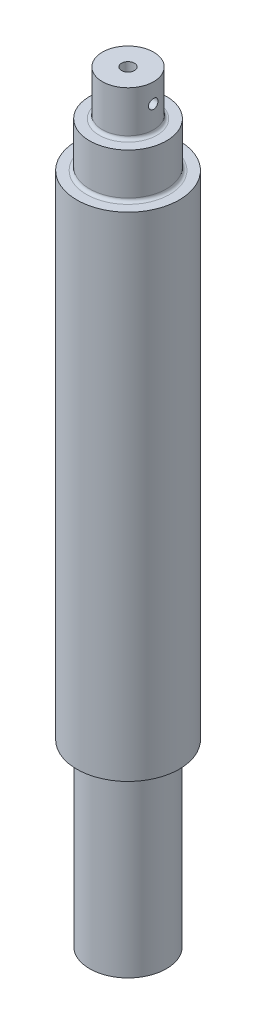
ISO-10303-21;
HEADER;
FILE_DESCRIPTION(('STEP AP214'),'2;1');
FILE_NAME('part.step','',(''),(''),'','','');
FILE_SCHEMA(('AUTOMOTIVE_DESIGN { 1 0 10303 214 1 1 1 1 }'));
ENDSEC;
DATA;
#1=APPLICATION_CONTEXT('core data for automotive mechanical design processes');
#2=APPLICATION_PROTOCOL_DEFINITION('international standard','automotive_design',2000,#1);
#3=PRODUCT_CONTEXT('',#1,'mechanical');
#4=PRODUCT('Part','Part','',(#3));
#5=PRODUCT_RELATED_PRODUCT_CATEGORY('part','',(#4));
#6=PRODUCT_DEFINITION_FORMATION('','',#4);
#7=PRODUCT_DEFINITION_CONTEXT('part definition',#1,'design');
#8=PRODUCT_DEFINITION('design','',#6,#7);
#9=PRODUCT_DEFINITION_SHAPE('','',#8);
#10=(LENGTH_UNIT() NAMED_UNIT(*) SI_UNIT(.MILLI.,.METRE.));
#11=(NAMED_UNIT(*) PLANE_ANGLE_UNIT() SI_UNIT($,.RADIAN.));
#12=(NAMED_UNIT(*) SI_UNIT($,.STERADIAN.) SOLID_ANGLE_UNIT());
#13=UNCERTAINTY_MEASURE_WITH_UNIT(LENGTH_MEASURE(1.E-05),#10,'distance_accuracy_value','');
#14=(GEOMETRIC_REPRESENTATION_CONTEXT(3) GLOBAL_UNCERTAINTY_ASSIGNED_CONTEXT((#13)) GLOBAL_UNIT_ASSIGNED_CONTEXT((#10,
#11,#12)) REPRESENTATION_CONTEXT('',''));
#15=CARTESIAN_POINT('',(0.,0.,0.));
#16=DIRECTION('',(0.,0.,1.));
#17=DIRECTION('',(1.,0.,0.));
#18=AXIS2_PLACEMENT_3D('',#15,#16,#17);
#19=CARTESIAN_POINT('',(9.51229999999999,-105.56875,0.));
#20=DIRECTION('',(0.,1.,0.));
#21=DIRECTION('',(0.,0.,1.));
#22=AXIS2_PLACEMENT_3D('',#19,#20,#21);
#23=PLANE('',#22);
#24=CARTESIAN_POINT('',(0.,-105.56875,0.));
#25=DIRECTION('',(0.,-1.,0.));
#26=DIRECTION('',(0.,0.,-1.));
#27=AXIS2_PLACEMENT_3D('',#24,#25,#26);
#28=CIRCLE('',#27,9.51229999999999);
#29=CARTESIAN_POINT('',(0.,-105.56875,-9.51229999999999));
#30=VERTEX_POINT('',#29);
#31=EDGE_CURVE('E10',#30,#30,#28,.T.);
#32=ORIENTED_EDGE('',*,*,#31,.T.);
#33=EDGE_LOOP('',(#32));
#34=FACE_BOUND('',#33,.T.);
#35=ADVANCED_FACE('F33',(#34),#23,.F.);
#36=CARTESIAN_POINT('',(0.,-122.193490480669,0.));
#37=DIRECTION('',(0.,-1.,0.));
#38=DIRECTION('',(0.,0.,-1.));
#39=AXIS2_PLACEMENT_3D('',#36,#37,#38);
#40=CYLINDRICAL_SURFACE('',#39,9.51229999999999);
#41=ORIENTED_EDGE('',*,*,#31,.F.);
#42=EDGE_LOOP('',(#41));
#43=FACE_BOUND('',#42,.T.);
#44=CARTESIAN_POINT('',(0.,-61.9125,0.));
#45=DIRECTION('',(0.,-1.,0.));
#46=DIRECTION('',(0.,0.,-1.));
#47=AXIS2_PLACEMENT_3D('',#44,#45,#46);
#48=CIRCLE('',#47,9.51229999999999);
#49=CARTESIAN_POINT('',(0.,-61.9125,-9.51229999999999));
#50=VERTEX_POINT('',#49);
#51=EDGE_CURVE('E44',#50,#50,#48,.T.);
#52=ORIENTED_EDGE('',*,*,#51,.T.);
#53=EDGE_LOOP('',(#52));
#54=FACE_BOUND('',#53,.T.);
#55=ADVANCED_FACE('F117',(#43,#54),#40,.T.);
#56=CARTESIAN_POINT('',(0.,-61.9125,0.));
#57=DIRECTION('',(0.,-1.,0.));
#58=DIRECTION('',(0.,0.,-1.));
#59=AXIS2_PLACEMENT_3D('',#56,#57,#58);
#60=TOROIDAL_SURFACE('',#59,10.30605,0.793750000000005);
#61=ORIENTED_EDGE('',*,*,#51,.F.);
#62=EDGE_LOOP('',(#61));
#63=FACE_BOUND('',#62,.T.);
#64=CARTESIAN_POINT('',(0.,-61.11875,0.));
#65=DIRECTION('',(0.,-1.,0.));
#66=DIRECTION('',(0.,0.,-1.));
#67=AXIS2_PLACEMENT_3D('',#64,#65,#66);
#68=CIRCLE('',#67,10.30605);
#69=CARTESIAN_POINT('',(0.,-61.11875,-10.30605));
#70=VERTEX_POINT('',#69);
#71=EDGE_CURVE('E49',#70,#70,#68,.T.);
#72=ORIENTED_EDGE('',*,*,#71,.T.);
#73=EDGE_LOOP('',(#72));
#74=FACE_BOUND('',#73,.T.);
#75=ADVANCED_FACE('F114',(#63,#74),#60,.F.);
#76=CARTESIAN_POINT('',(12.7,-61.11875,0.));
#77=DIRECTION('',(0.,1.,0.));
#78=DIRECTION('',(0.,0.,1.));
#79=AXIS2_PLACEMENT_3D('',#76,#77,#78);
#80=PLANE('',#79);
#81=ORIENTED_EDGE('',*,*,#71,.F.);
#82=EDGE_LOOP('',(#81));
#83=FACE_BOUND('',#82,.T.);
#84=CARTESIAN_POINT('',(0.,-61.11875,0.));
#85=DIRECTION('',(0.,-1.,0.));
#86=DIRECTION('',(0.,0.,-1.));
#87=AXIS2_PLACEMENT_3D('',#84,#85,#86);
#88=CIRCLE('',#87,12.7);
#89=CARTESIAN_POINT('',(0.,-61.11875,-12.7));
#90=VERTEX_POINT('',#89);
#91=EDGE_CURVE('E129',#90,#90,#88,.T.);
#92=ORIENTED_EDGE('',*,*,#91,.T.);
#93=EDGE_LOOP('',(#92));
#94=FACE_BOUND('',#93,.T.);
#95=ADVANCED_FACE('F110',(#83,#94),#80,.F.);
#96=CARTESIAN_POINT('',(0.,-122.193490480669,0.));
#97=DIRECTION('',(0.,-1.,0.));
#98=DIRECTION('',(0.,0.,-1.));
#99=AXIS2_PLACEMENT_3D('',#96,#97,#98);
#100=CYLINDRICAL_SURFACE('',#99,12.7);
#101=ORIENTED_EDGE('',*,*,#91,.F.);
#102=EDGE_LOOP('',(#101));
#103=FACE_BOUND('',#102,.T.);
#104=CARTESIAN_POINT('',(0.,61.11875,0.));
#105=DIRECTION('',(0.,-1.,0.));
#106=DIRECTION('',(0.,0.,-1.));
#107=AXIS2_PLACEMENT_3D('',#104,#105,#106);
#108=CIRCLE('',#107,12.7);
#109=CARTESIAN_POINT('',(0.,61.11875,-12.7));
#110=VERTEX_POINT('',#109);
#111=EDGE_CURVE('E131',#110,#110,#108,.T.);
#112=ORIENTED_EDGE('',*,*,#111,.T.);
#113=EDGE_LOOP('',(#112));
#114=FACE_BOUND('',#113,.T.);
#115=ADVANCED_FACE('F106',(#103,#114),#100,.T.);
#116=CARTESIAN_POINT('',(10.33145,61.11875,0.));
#117=DIRECTION('',(0.,-1.,0.));
#118=DIRECTION('',(0.,0.,-1.));
#119=AXIS2_PLACEMENT_3D('',#116,#117,#118);
#120=PLANE('',#119);
#121=ORIENTED_EDGE('',*,*,#111,.F.);
#122=EDGE_LOOP('',(#121));
#123=FACE_BOUND('',#122,.T.);
#124=CARTESIAN_POINT('',(0.,61.11875,0.));
#125=DIRECTION('',(0.,-1.,0.));
#126=DIRECTION('',(0.,0.,-1.));
#127=AXIS2_PLACEMENT_3D('',#124,#125,#126);
#128=CIRCLE('',#127,10.33145);
#129=CARTESIAN_POINT('',(0.,61.11875,-10.33145));
#130=VERTEX_POINT('',#129);
#131=EDGE_CURVE('E136',#130,#130,#128,.T.);
#132=ORIENTED_EDGE('',*,*,#131,.T.);
#133=EDGE_LOOP('',(#132));
#134=FACE_BOUND('',#133,.T.);
#135=ADVANCED_FACE('F102',(#123,#134),#120,.F.);
#136=CARTESIAN_POINT('',(0.,61.9125,0.));
#137=DIRECTION('',(0.,-1.,0.));
#138=DIRECTION('',(0.,0.,-1.));
#139=AXIS2_PLACEMENT_3D('',#136,#137,#138);
#140=TOROIDAL_SURFACE('',#139,10.33145,0.793750000000004);
#141=ORIENTED_EDGE('',*,*,#131,.F.);
#142=EDGE_LOOP('',(#141));
#143=FACE_BOUND('',#142,.T.);
#144=CARTESIAN_POINT('',(0.,61.9125,0.));
#145=DIRECTION('',(0.,-1.,0.));
#146=DIRECTION('',(0.,0.,-1.));
#147=AXIS2_PLACEMENT_3D('',#144,#145,#146);
#148=CIRCLE('',#147,9.5377);
#149=CARTESIAN_POINT('',(0.,61.9125,-9.5377));
#150=VERTEX_POINT('',#149);
#151=EDGE_CURVE('E139',#150,#150,#148,.T.);
#152=ORIENTED_EDGE('',*,*,#151,.T.);
#153=EDGE_LOOP('',(#152));
#154=FACE_BOUND('',#153,.T.);
#155=ADVANCED_FACE('F98',(#143,#154),#140,.F.);
#156=CARTESIAN_POINT('',(0.,-122.193490480669,0.));
#157=DIRECTION('',(0.,-1.,0.));
#158=DIRECTION('',(0.,0.,-1.));
#159=AXIS2_PLACEMENT_3D('',#156,#157,#158);
#160=CYLINDRICAL_SURFACE('',#159,9.5377);
#161=ORIENTED_EDGE('',*,*,#151,.F.);
#162=EDGE_LOOP('',(#161));
#163=FACE_BOUND('',#162,.T.);
#164=CARTESIAN_POINT('',(0.,72.23125,0.));
#165=DIRECTION('',(0.,-1.,0.));
#166=DIRECTION('',(0.,0.,-1.));
#167=AXIS2_PLACEMENT_3D('',#164,#165,#166);
#168=CIRCLE('',#167,9.5377);
#169=CARTESIAN_POINT('',(0.,72.23125,-9.5377));
#170=VERTEX_POINT('',#169);
#171=EDGE_CURVE('E142',#170,#170,#168,.T.);
#172=ORIENTED_EDGE('',*,*,#171,.T.);
#173=EDGE_LOOP('',(#172));
#174=FACE_BOUND('',#173,.T.);
#175=ADVANCED_FACE('F94',(#163,#174),#160,.T.);
#176=CARTESIAN_POINT('',(7.14375,72.23125,0.));
#177=DIRECTION('',(0.,-1.,0.));
#178=DIRECTION('',(0.,0.,-1.));
#179=AXIS2_PLACEMENT_3D('',#176,#177,#178);
#180=PLANE('',#179);
#181=ORIENTED_EDGE('',*,*,#171,.F.);
#182=EDGE_LOOP('',(#181));
#183=FACE_BOUND('',#182,.T.);
#184=CARTESIAN_POINT('',(0.,72.23125,0.));
#185=DIRECTION('',(0.,-1.,0.));
#186=DIRECTION('',(0.,0.,-1.));
#187=AXIS2_PLACEMENT_3D('',#184,#185,#186);
#188=CIRCLE('',#187,7.14375);
#189=CARTESIAN_POINT('',(0.,72.23125,-7.14375));
#190=VERTEX_POINT('',#189);
#191=EDGE_CURVE('E145',#190,#190,#188,.T.);
#192=ORIENTED_EDGE('',*,*,#191,.T.);
#193=EDGE_LOOP('',(#192));
#194=FACE_BOUND('',#193,.T.);
#195=ADVANCED_FACE('F90',(#183,#194),#180,.F.);
#196=CARTESIAN_POINT('',(0.,73.025,0.));
#197=DIRECTION('',(0.,-1.,0.));
#198=DIRECTION('',(0.,0.,-1.));
#199=AXIS2_PLACEMENT_3D('',#196,#197,#198);
#200=TOROIDAL_SURFACE('',#199,7.14375,0.793749999999998);
#201=ORIENTED_EDGE('',*,*,#191,.F.);
#202=EDGE_LOOP('',(#201));
#203=FACE_BOUND('',#202,.T.);
#204=CARTESIAN_POINT('',(0.,73.025,0.));
#205=DIRECTION('',(0.,-1.,0.));
#206=DIRECTION('',(0.,0.,-1.));
#207=AXIS2_PLACEMENT_3D('',#204,#205,#206);
#208=CIRCLE('',#207,6.35);
#209=CARTESIAN_POINT('',(0.,73.025,-6.35));
#210=VERTEX_POINT('',#209);
#211=EDGE_CURVE('E148',#210,#210,#208,.T.);
#212=ORIENTED_EDGE('',*,*,#211,.T.);
#213=EDGE_LOOP('',(#212));
#214=FACE_BOUND('',#213,.T.);
#215=ADVANCED_FACE('F85',(#203,#214),#200,.F.);
#216=CARTESIAN_POINT('',(0.,-122.193490480669,0.));
#217=DIRECTION('',(0.,-1.,0.));
#218=DIRECTION('',(0.,0.,-1.));
#219=AXIS2_PLACEMENT_3D('',#216,#217,#218);
#220=CYLINDRICAL_SURFACE('',#219,6.35);
#221=CARTESIAN_POINT('',(-6.23919087622746,78.58125,-1.1811));
#222=CARTESIAN_POINT('',(-6.23919214333231,78.6469742743768,-1.18109746909249));
#223=CARTESIAN_POINT('',(-6.24024067225326,78.7127314988334,-1.17559538481475));
#224=CARTESIAN_POINT('',(-6.24431637828758,78.8423924465617,-1.15374685870026));
#225=CARTESIAN_POINT('',(-6.24734524492888,78.9062945384614,-1.13739115690606));
#226=CARTESIAN_POINT('',(-6.2550269885992,79.0303503478851,-1.0943544693445));
#227=CARTESIAN_POINT('',(-6.25967836426377,79.0905074703233,-1.06768302662012));
#228=CARTESIAN_POINT('',(-6.27007925522761,79.2054892617887,-1.00479712964858));
#229=CARTESIAN_POINT('',(-6.27582868197869,79.2603143602591,-0.968583444810168));
#230=CARTESIAN_POINT('',(-6.28785652254082,79.3637516385008,-0.887168203589547));
#231=CARTESIAN_POINT('',(-6.29414004963648,79.4122890245743,-0.841872363745582));
#232=CARTESIAN_POINT('',(-6.30648291453046,79.5011215738042,-0.743782364286707));
#233=CARTESIAN_POINT('',(-6.3125422377015,79.541416199969,-0.690987716525811));
#234=CARTESIAN_POINT('',(-6.3238087008751,79.6129055832109,-0.578907971919412));
#235=CARTESIAN_POINT('',(-6.3290091148989,79.6440298888251,-0.519577204065102));
#236=CARTESIAN_POINT('',(-6.33791460400823,79.6958413103524,-0.396415973391421));
#237=CARTESIAN_POINT('',(-6.34161980006762,79.7165292706747,-0.332585875091198));
#238=CARTESIAN_POINT('',(-6.34708126347029,79.7466496527312,-0.203012778342513));
#239=CARTESIAN_POINT('',(-6.34885934167225,79.7562081304726,-0.137300017194504));
#240=CARTESIAN_POINT('',(-6.3503413865339,79.7641909290882,-0.00518108697258029));
#241=CARTESIAN_POINT('',(-6.3500455271143,79.7626161835961,0.0612250234906255));
#242=CARTESIAN_POINT('',(-6.34743009331833,79.7484740365908,0.191981343628011));
#243=CARTESIAN_POINT('',(-6.34513550655649,79.7360423608668,0.256346804897117));
#244=CARTESIAN_POINT('',(-6.33880845182242,79.7007538332646,0.382061889747008));
#245=CARTESIAN_POINT('',(-6.33477592126345,79.6778966059402,0.443411404629063));
#246=CARTESIAN_POINT('',(-6.32538425269894,79.6222760667846,0.561747547840611));
#247=CARTESIAN_POINT('',(-6.32001786196157,79.5894583727703,0.618708016261645));
#248=CARTESIAN_POINT('',(-6.30855214988407,79.5148885270081,0.726364271016557));
#249=CARTESIAN_POINT('',(-6.30245275517845,79.4731354806046,0.777059429231437));
#250=CARTESIAN_POINT('',(-6.29008819347049,79.3811318508526,0.871550014485246));
#251=CARTESIAN_POINT('',(-6.28382191388055,79.3307625334409,0.915229764881632));
#252=CARTESIAN_POINT('',(-6.27191789915018,79.2233520287483,0.993538882781834));
#253=CARTESIAN_POINT('',(-6.26628017292023,79.1663107469082,1.02816812199355));
#254=CARTESIAN_POINT('',(-6.25627004557234,79.0470235916951,1.08742542184262));
#255=CARTESIAN_POINT('',(-6.2518997470884,78.984769287999,1.11203689020552));
#256=CARTESIAN_POINT('',(-6.24495166916172,78.8569097391622,1.15041856555903));
#257=CARTESIAN_POINT('',(-6.24237369010287,78.7913048680584,1.16418997986228));
#258=CARTESIAN_POINT('',(-6.23934156814729,78.6596489619043,1.18033218928201));
#259=CARTESIAN_POINT('',(-6.23885648609295,78.5936189831359,1.1828690786022));
#260=CARTESIAN_POINT('',(-6.23998231712425,78.4620788451608,1.17691526242471));
#261=CARTESIAN_POINT('',(-6.24159312829611,78.3965686608347,1.16842509312299));
#262=CARTESIAN_POINT('',(-6.24670044585602,78.2684723526693,1.1408006794374));
#263=CARTESIAN_POINT('',(-6.25018155348231,78.2058668236101,1.12175331594378));
#264=CARTESIAN_POINT('',(-6.2586239902392,78.0847358396149,1.07364730222163));
#265=CARTESIAN_POINT('',(-6.26358542694373,78.0262106815763,1.04458792440698));
#266=CARTESIAN_POINT('',(-6.27450005683534,77.9141694646451,0.976899758497382));
#267=CARTESIAN_POINT('',(-6.28046388402076,77.8607179188583,0.938165931769553));
#268=CARTESIAN_POINT('',(-6.29268132020818,77.7610130635191,0.852370209854268));
#269=CARTESIAN_POINT('',(-6.29893495479521,77.7147603910808,0.805307578338262));
#270=CARTESIAN_POINT('',(-6.3111266824786,77.6301467636977,0.703448802826138));
#271=CARTESIAN_POINT('',(-6.31705955214349,77.5918974438012,0.648559200596776));
#272=CARTESIAN_POINT('',(-6.32785370439178,77.525163702631,0.533036642473319));
#273=CARTESIAN_POINT('',(-6.33271502776488,77.4966789096356,0.472403905324288));
#274=CARTESIAN_POINT('',(-6.34079586663405,77.4504504186689,0.347426413618903));
#275=CARTESIAN_POINT('',(-6.34402378970181,77.4326516265925,0.28310260548595));
#276=CARTESIAN_POINT('',(-6.34850997045743,77.408124425137,0.152312998549604));
#277=CARTESIAN_POINT('',(-6.34976843194467,77.4013948703124,0.0858474221024029));
#278=CARTESIAN_POINT('',(-6.3501699313238,77.3992365282945,-0.0462679108442915));
#279=CARTESIAN_POINT('',(-6.34934454898265,77.4036390409084,-0.111914875013605));
#280=CARTESIAN_POINT('',(-6.34573663650123,77.4232507292213,-0.241516439568876));
#281=CARTESIAN_POINT('',(-6.3429541244836,77.4384598048536,-0.305471055619954));
#282=CARTESIAN_POINT('',(-6.335744478339,77.47918226815,-0.42978518407606));
#283=CARTESIAN_POINT('',(-6.33132016807059,77.5046779695654,-0.490150664075892));
#284=CARTESIAN_POINT('',(-6.3213061678523,77.5652298497475,-0.60577214590407));
#285=CARTESIAN_POINT('',(-6.31571640150205,77.6002866553297,-0.661027812420493));
#286=CARTESIAN_POINT('',(-6.30388902812957,77.6795476210369,-0.765702525780121));
#287=CARTESIAN_POINT('',(-6.29764339777353,77.7238737905787,-0.815028289673123));
#288=CARTESIAN_POINT('',(-6.28525921685833,77.8201617993133,-0.90560002386348));
#289=CARTESIAN_POINT('',(-6.27912069181473,77.8721254309173,-0.94684409217797));
#290=CARTESIAN_POINT('',(-6.26758488324089,77.9827776078175,-1.02043306226875));
#291=CARTESIAN_POINT('',(-6.26219483743212,78.0415229389071,-1.05269374618485));
#292=CARTESIAN_POINT('',(-6.25285321915319,78.1636805082471,-1.1068367959707));
#293=CARTESIAN_POINT('',(-6.24890028364601,78.2270882553949,-1.12872900189277));
#294=CARTESIAN_POINT('',(-6.24370869479962,78.3391149458017,-1.15704109539825));
#295=CARTESIAN_POINT('',(-6.24202452459754,78.3870761924548,-1.16604779811131));
#296=CARTESIAN_POINT('',(-6.23976516005418,78.4837689303849,-1.17807810990563));
#297=CARTESIAN_POINT('',(-6.23918993637908,78.5325004012536,-1.18110187724744));
#298=CARTESIAN_POINT('',(-6.23919087622746,78.58125,-1.1811));
#299=B_SPLINE_CURVE_WITH_KNOTS('',3,(#221,#222,#223,#224,#225,#226,#227,#228,#229,#230,#231,
#232,#233,#234,#235,#236,#237,#238,#239,#240,#241,#242,#243,#244,#245,#246,#247,#248,#249,#250,
#251,#252,#253,#254,#255,#256,#257,#258,#259,#260,#261,#262,#263,#264,#265,#266,#267,#268,#269,
#270,#271,#272,#273,#274,#275,#276,#277,#278,#279,#280,#281,#282,#283,#284,#285,#286,#287,#288,
#289,#290,#291,#292,#293,#294,#295,#296,#297,#298),.UNSPECIFIED.,.T.,.F.,(4,2,2,2,2,2,2,2,2,2,2,
2,2,2,2,2,2,2,2,2,2,2,2,2,2,2,2,2,2,2,2,2,2,2,2,2,2,2,4),(0.,0.196994433415169,
0.394157152599833,0.591137912071507,0.788102793475247,0.98722944937713,1.18636907366885,
1.38700092915119,1.58761654882171,1.78593712294843,1.98424106608242,2.18010087552968,
2.37596773885824,2.5729238442016,2.76989967908526,2.96984825320471,3.16979966146588,
3.37008091150503,3.57033985203286,3.76762800961033,3.96490657431683,4.16058522770232,
4.35627810431084,4.55419581439584,4.75213103063349,4.95266607046305,5.15319347536409,
5.35267793349141,5.55214174765175,5.74860097322023,5.94505837963885,6.14117943789884,
6.33731335673268,6.53621279654494,6.73515899017932,6.9359118833751,7.13647387130141,
7.28259421594522,7.42871069536355),.UNSPECIFIED.);
#300=CARTESIAN_POINT('',(-6.23919087622746,78.58125,-1.1811));
#301=VERTEX_POINT('',#300);
#302=EDGE_CURVE('E76',#301,#301,#299,.T.);
#303=ORIENTED_EDGE('',*,*,#302,.T.);
#304=EDGE_LOOP('',(#303));
#305=FACE_BOUND('',#304,.T.);
#306=CARTESIAN_POINT('',(6.23919087622746,78.58125,-1.1811));
#307=CARTESIAN_POINT('',(6.23919214333231,78.5155257256232,-1.18109746909249));
#308=CARTESIAN_POINT('',(6.24024067225326,78.4497685011665,-1.17559538481475));
#309=CARTESIAN_POINT('',(6.24431637828758,78.3201075534382,-1.15374685870026));
#310=CARTESIAN_POINT('',(6.24734524492888,78.2562054615386,-1.13739115690606));
#311=CARTESIAN_POINT('',(6.2550269885992,78.1321496521148,-1.0943544693445));
#312=CARTESIAN_POINT('',(6.25967836426377,78.0719925296767,-1.06768302662012));
#313=CARTESIAN_POINT('',(6.27007925522761,77.9570107382113,-1.00479712964858));
#314=CARTESIAN_POINT('',(6.27582868197869,77.9021856397409,-0.968583444810168));
#315=CARTESIAN_POINT('',(6.28785652254082,77.7987483614992,-0.887168203589543));
#316=CARTESIAN_POINT('',(6.29414004963648,77.7502109754257,-0.841872363745574));
#317=CARTESIAN_POINT('',(6.30648291453046,77.6613784261958,-0.743782364286698));
#318=CARTESIAN_POINT('',(6.3125422377015,77.6210838000309,-0.690987716525805));
#319=CARTESIAN_POINT('',(6.3238087008751,77.5495944167891,-0.578907971919413));
#320=CARTESIAN_POINT('',(6.3290091148989,77.5184701111749,-0.519577204065105));
#321=CARTESIAN_POINT('',(6.33791460400823,77.4666586896476,-0.396415973391425));
#322=CARTESIAN_POINT('',(6.34161980006762,77.4459707293253,-0.3325858750912));
#323=CARTESIAN_POINT('',(6.34708126347029,77.4158503472688,-0.203012778342514));
#324=CARTESIAN_POINT('',(6.34885934167225,77.4062918695274,-0.137300017194504));
#325=CARTESIAN_POINT('',(6.3503413865339,77.3983090709118,-0.00518108697258085));
#326=CARTESIAN_POINT('',(6.3500455271143,77.3998838164039,0.0612250234906253));
#327=CARTESIAN_POINT('',(6.34743009331833,77.4140259634091,0.191981343628011));
#328=CARTESIAN_POINT('',(6.34513550655649,77.4264576391331,0.256346804897117));
#329=CARTESIAN_POINT('',(6.33880845182242,77.4617461667354,0.382061889747008));
#330=CARTESIAN_POINT('',(6.33477592126345,77.4846033940597,0.443411404629063));
#331=CARTESIAN_POINT('',(6.32538425269894,77.5402239332154,0.561747547840611));
#332=CARTESIAN_POINT('',(6.32001786196157,77.5730416272297,0.618708016261645));
#333=CARTESIAN_POINT('',(6.30855214988407,77.6476114729918,0.726364271016557));
#334=CARTESIAN_POINT('',(6.30245275517845,77.6893645193954,0.777059429231437));
#335=CARTESIAN_POINT('',(6.29008819347049,77.7813681491474,0.871550014485246));
#336=CARTESIAN_POINT('',(6.28382191388055,77.8317374665591,0.915229764881632));
#337=CARTESIAN_POINT('',(6.27191789915018,77.9391479712517,0.993538882781834));
#338=CARTESIAN_POINT('',(6.26628017292023,77.9961892530918,1.02816812199355));
#339=CARTESIAN_POINT('',(6.25627004557234,78.1154764083049,1.08742542184262));
#340=CARTESIAN_POINT('',(6.2518997470884,78.177730712001,1.11203689020552));
#341=CARTESIAN_POINT('',(6.24495166916172,78.3055902608378,1.15041856555903));
#342=CARTESIAN_POINT('',(6.24237369010287,78.3711951319416,1.16418997986228));
#343=CARTESIAN_POINT('',(6.23934156814729,78.5028510380957,1.18033218928201));
#344=CARTESIAN_POINT('',(6.23885648609295,78.5688810168641,1.1828690786022));
#345=CARTESIAN_POINT('',(6.23998231712425,78.7004211548392,1.17691526242471));
#346=CARTESIAN_POINT('',(6.24159312829611,78.7659313391653,1.16842509312299));
#347=CARTESIAN_POINT('',(6.24670044585602,78.8940276473307,1.1408006794374));
#348=CARTESIAN_POINT('',(6.25018155348231,78.9566331763898,1.12175331594378));
#349=CARTESIAN_POINT('',(6.2586239902392,79.0777641603851,1.07364730222163));
#350=CARTESIAN_POINT('',(6.26358542694373,79.1362893184236,1.04458792440698));
#351=CARTESIAN_POINT('',(6.27450005683534,79.2483305353549,0.976899758497382));
#352=CARTESIAN_POINT('',(6.28046388402076,79.3017820811417,0.938165931769553));
#353=CARTESIAN_POINT('',(6.29268132020818,79.4014869364809,0.852370209854268));
#354=CARTESIAN_POINT('',(6.29893495479521,79.4477396089191,0.805307578338262));
#355=CARTESIAN_POINT('',(6.3111266824786,79.5323532363023,0.703448802826138));
#356=CARTESIAN_POINT('',(6.31705955214349,79.5706025561988,0.648559200596776));
#357=CARTESIAN_POINT('',(6.32785370439178,79.637336297369,0.533036642473319));
#358=CARTESIAN_POINT('',(6.33271502776488,79.6658210903643,0.472403905324288));
#359=CARTESIAN_POINT('',(6.34079586663405,79.7120495813311,0.347426413618903));
#360=CARTESIAN_POINT('',(6.34402378970181,79.7298483734075,0.28310260548595));
#361=CARTESIAN_POINT('',(6.34850997045743,79.754375574863,0.152312998549604));
#362=CARTESIAN_POINT('',(6.34976843194467,79.7611051296876,0.0858474221024029));
#363=CARTESIAN_POINT('',(6.3501699313238,79.7632634717055,-0.0462679108442915));
#364=CARTESIAN_POINT('',(6.34934454898265,79.7588609590916,-0.111914875013605));
#365=CARTESIAN_POINT('',(6.34573663650123,79.7392492707787,-0.241516439568876));
#366=CARTESIAN_POINT('',(6.3429541244836,79.7240401951464,-0.305471055619954));
#367=CARTESIAN_POINT('',(6.335744478339,79.68331773185,-0.42978518407606));
#368=CARTESIAN_POINT('',(6.33132016807059,79.6578220304346,-0.490150664075892));
#369=CARTESIAN_POINT('',(6.3213061678523,79.5972701502525,-0.60577214590407));
#370=CARTESIAN_POINT('',(6.31571640150205,79.5622133446703,-0.661027812420493));
#371=CARTESIAN_POINT('',(6.30388902812957,79.482952378963,-0.765702525780121));
#372=CARTESIAN_POINT('',(6.29764339777353,79.4386262094213,-0.815028289673123));
#373=CARTESIAN_POINT('',(6.28525921685833,79.3423382006867,-0.90560002386348));
#374=CARTESIAN_POINT('',(6.27912069181473,79.2903745690827,-0.94684409217797));
#375=CARTESIAN_POINT('',(6.26758488324089,79.1797223921824,-1.02043306226875));
#376=CARTESIAN_POINT('',(6.26219483743212,79.1209770610929,-1.05269374618485));
#377=CARTESIAN_POINT('',(6.2528532191532,78.9988194917529,-1.10683679597069));
#378=CARTESIAN_POINT('',(6.24890028364601,78.9354117446051,-1.12872900189277));
#379=CARTESIAN_POINT('',(6.24370869479962,78.8233850541982,-1.15704109539825));
#380=CARTESIAN_POINT('',(6.24202452459754,78.7754238075452,-1.16604779811131));
#381=CARTESIAN_POINT('',(6.23976516005418,78.6787310696151,-1.17807810990563));
#382=CARTESIAN_POINT('',(6.23918993637908,78.6299995987464,-1.18110187724744));
#383=CARTESIAN_POINT('',(6.23919087622746,78.58125,-1.1811));
#384=B_SPLINE_CURVE_WITH_KNOTS('',3,(#306,#307,#308,#309,#310,#311,#312,#313,#314,#315,#316,
#317,#318,#319,#320,#321,#322,#323,#324,#325,#326,#327,#328,#329,#330,#331,#332,#333,#334,#335,
#336,#337,#338,#339,#340,#341,#342,#343,#344,#345,#346,#347,#348,#349,#350,#351,#352,#353,#354,
#355,#356,#357,#358,#359,#360,#361,#362,#363,#364,#365,#366,#367,#368,#369,#370,#371,#372,#373,
#374,#375,#376,#377,#378,#379,#380,#381,#382,#383),.UNSPECIFIED.,.T.,.F.,(4,2,2,2,2,2,2,2,2,2,2,
2,2,2,2,2,2,2,2,2,2,2,2,2,2,2,2,2,2,2,2,2,2,2,2,2,2,2,4),(0.,0.196994433415169,
0.394157152599833,0.591137912071507,0.788102793475247,0.98722944937715,1.18636907366885,
1.38700092915118,1.58761654882171,1.78593712294843,1.98424106608242,2.18010087552968,
2.37596773885824,2.5729238442016,2.76989967908526,2.96984825320471,3.16979966146588,
3.37008091150503,3.57033985203286,3.76762800961033,3.96490657431683,4.16058522770232,
4.35627810431084,4.55419581439584,4.75213103063349,4.95266607046305,5.15319347536409,
5.35267793349141,5.55214174765175,5.74860097322023,5.94505837963885,6.14117943789884,
6.33731335673268,6.53621279654494,6.73515899017932,6.93591188337509,7.13647387130141,
7.28259421594522,7.42871069536355),.UNSPECIFIED.);
#385=CARTESIAN_POINT('',(6.23919087622746,78.58125,-1.1811));
#386=VERTEX_POINT('',#385);
#387=EDGE_CURVE('E71',#386,#386,#384,.T.);
#388=ORIENTED_EDGE('',*,*,#387,.T.);
#389=EDGE_LOOP('',(#388));
#390=FACE_BOUND('',#389,.T.);
#391=ORIENTED_EDGE('',*,*,#211,.F.);
#392=EDGE_LOOP('',(#391));
#393=FACE_BOUND('',#392,.T.);
#394=CARTESIAN_POINT('',(0.,83.34375,0.));
#395=DIRECTION('',(0.,-1.,0.));
#396=DIRECTION('',(0.,0.,-1.));
#397=AXIS2_PLACEMENT_3D('',#394,#395,#396);
#398=CIRCLE('',#397,6.35);
#399=CARTESIAN_POINT('',(0.,83.34375,-6.35));
#400=VERTEX_POINT('',#399);
#401=EDGE_CURVE('E151',#400,#400,#398,.T.);
#402=ORIENTED_EDGE('',*,*,#401,.T.);
#403=EDGE_LOOP('',(#402));
#404=FACE_BOUND('',#403,.T.);
#405=ADVANCED_FACE('F80',(#305,#390,#393,#404),#220,.T.);
#406=CARTESIAN_POINT('',(0.,83.34375,0.));
#407=DIRECTION('',(0.,-1.,0.));
#408=DIRECTION('',(0.,0.,-1.));
#409=AXIS2_PLACEMENT_3D('',#406,#407,#408);
#410=PLANE('',#409);
#411=CARTESIAN_POINT('',(0.,83.34375,0.));
#412=DIRECTION('',(0.,1.,0.));
#413=DIRECTION('',(0.,0.,1.));
#414=AXIS2_PLACEMENT_3D('',#411,#412,#413);
#415=CIRCLE('',#414,1.6002);
#416=CARTESIAN_POINT('',(0.,83.34375,1.6002));
#417=VERTEX_POINT('',#416);
#418=EDGE_CURVE('E155',#417,#417,#415,.T.);
#419=ORIENTED_EDGE('',*,*,#418,.F.);
#420=EDGE_LOOP('',(#419));
#421=FACE_BOUND('',#420,.T.);
#422=ORIENTED_EDGE('',*,*,#401,.F.);
#423=EDGE_LOOP('',(#422));
#424=FACE_BOUND('',#423,.T.);
#425=ADVANCED_FACE('F84',(#421,#424),#410,.F.);
#426=CARTESIAN_POINT('',(0.,70.64375,0.));
#427=DIRECTION('',(0.,1.,0.));
#428=DIRECTION('',(0.,0.,1.));
#429=AXIS2_PLACEMENT_3D('',#426,#427,#428);
#430=CYLINDRICAL_SURFACE('',#429,1.6002);
#431=CARTESIAN_POINT('',(-1.07964940142622,78.58125,-1.1811));
#432=CARTESIAN_POINT('',(-1.07966009307309,78.5257441411836,-1.18109472342243));
#433=CARTESIAN_POINT('',(-1.08402721541749,78.4702057267564,-1.17714277728306));
#434=CARTESIAN_POINT('',(-1.10049079032745,78.3613142376383,-1.16175464875227));
#435=CARTESIAN_POINT('',(-1.11260844766679,78.3079675868687,-1.15029793189296));
#436=CARTESIAN_POINT('',(-1.14212038765746,78.2055093325865,-1.12099206202687));
#437=CARTESIAN_POINT('',(-1.15944378257462,78.1563515650214,-1.10322823847549));
#438=CARTESIAN_POINT('',(-1.19729862453575,78.0618691048784,-1.06202587744138));
#439=CARTESIAN_POINT('',(-1.2178298890203,78.0165441943993,-1.0385876628458));
#440=CARTESIAN_POINT('',(-1.26467734606782,77.9210763997986,-0.981254597142732));
#441=CARTESIAN_POINT('',(-1.2913278320769,77.871790799062,-0.946205316545057));
#442=CARTESIAN_POINT('',(-1.34453487675478,77.7790211094045,-0.868949761668534));
#443=CARTESIAN_POINT('',(-1.37109124843005,77.7355453537592,-0.826733400181244));
#444=CARTESIAN_POINT('',(-1.42714690388459,77.6471786808019,-0.726497686514091));
#445=CARTESIAN_POINT('',(-1.45621281572777,77.6036595921091,-0.667001804153231));
#446=CARTESIAN_POINT('',(-1.50826916411515,77.5276875064934,-0.538986121742157));
#447=CARTESIAN_POINT('',(-1.53127330882417,77.4952094919857,-0.470487216733805));
#448=CARTESIAN_POINT('',(-1.56287658905314,77.4511624853477,-0.347599247316103));
#449=CARTESIAN_POINT('',(-1.57372215371021,77.4362540397121,-0.294975060968345));
#450=CARTESIAN_POINT('',(-1.59011894140098,77.4138188474088,-0.187383416630158));
#451=CARTESIAN_POINT('',(-1.59567468089087,77.4062858034627,-0.13241799955617));
#452=CARTESIAN_POINT('',(-1.60101934361684,77.399037629917,-0.0215543768851854));
#453=CARTESIAN_POINT('',(-1.60079422685281,77.3993415339674,0.0343457701137521));
#454=CARTESIAN_POINT('',(-1.59456401015353,77.4077937506182,0.145225658606423));
#455=CARTESIAN_POINT('',(-1.58855749204729,77.415943987915,0.200205170902897));
#456=CARTESIAN_POINT('',(-1.57156059438741,77.4392252795525,0.305973151716064));
#457=CARTESIAN_POINT('',(-1.56073286591328,77.4541287710942,0.356839043752675));
#458=CARTESIAN_POINT('',(-1.53493632124008,77.4901294936155,0.455190786413104));
#459=CARTESIAN_POINT('',(-1.51996663411117,77.511228027284,0.502675923522262));
#460=CARTESIAN_POINT('',(-1.48499822480968,77.5614762215719,0.59858448602897));
#461=CARTESIAN_POINT('',(-1.4646281904143,77.5912547453118,0.646540629023935));
#462=CARTESIAN_POINT('',(-1.42126109147475,77.6566211068764,0.737006703419282));
#463=CARTESIAN_POINT('',(-1.3982616335191,77.6922142502544,0.779511596997386));
#464=CARTESIAN_POINT('',(-1.34644185084273,77.7759239135112,0.866465623839628));
#465=CARTESIAN_POINT('',(-1.31735484069361,77.8251316221169,0.90970656477564));
#466=CARTESIAN_POINT('',(-1.25992670920035,77.930311566105,0.98770745693907));
#467=CARTESIAN_POINT('',(-1.23158581599975,77.9862858419355,1.02246484037589));
#468=CARTESIAN_POINT('',(-1.18442736165042,78.0923905990304,1.07646550982772));
#469=CARTESIAN_POINT('',(-1.16485646654993,78.1413043678297,1.09743260896912));
#470=CARTESIAN_POINT('',(-1.13040400228107,78.2429608551522,1.13289013161556));
#471=CARTESIAN_POINT('',(-1.1155118671607,78.2956946105122,1.14739517969027));
#472=CARTESIAN_POINT('',(-1.09483397126651,78.3944175712437,1.16711080758782));
#473=CARTESIAN_POINT('',(-1.08789317968983,78.4399174694082,1.17352267616273));
#474=CARTESIAN_POINT('',(-1.07981296879588,78.5318506667999,1.1809645731445));
#475=CARTESIAN_POINT('',(-1.07866747926928,78.5782829382065,1.18200023281703));
#476=CARTESIAN_POINT('',(-1.08236128271506,78.6706692862293,1.17861723973976));
#477=CARTESIAN_POINT('',(-1.08719742010478,78.7166236020963,1.17420146287519));
#478=CARTESIAN_POINT('',(-1.10207446099201,78.8069028259976,1.16024681881201));
#479=CARTESIAN_POINT('',(-1.11212375334689,78.8512249841269,1.1506996935006));
#480=CARTESIAN_POINT('',(-1.14084793016505,78.9543751944047,1.12234214248193));
#481=CARTESIAN_POINT('',(-1.16135951494791,79.0120873801194,1.10136830541822));
#482=CARTESIAN_POINT('',(-1.2065712070898,79.1222791961016,1.05164452675529));
#483=CARTESIAN_POINT('',(-1.23127971028057,79.1747479962064,1.02287892795258));
#484=CARTESIAN_POINT('',(-1.2830606032537,79.2759047485782,0.957185443904767));
#485=CARTESIAN_POINT('',(-1.31018396337979,79.3244120730631,0.920020636978707));
#486=CARTESIAN_POINT('',(-1.36379736310099,79.4153021859089,0.838496927495954));
#487=CARTESIAN_POINT('',(-1.39028777216698,79.4576886238849,0.794142345654969));
#488=CARTESIAN_POINT('',(-1.44047091860176,79.5352822423738,0.698963698743847));
#489=CARTESIAN_POINT('',(-1.46418858423671,79.5705558627012,0.648207472368878));
#490=CARTESIAN_POINT('',(-1.50730235693645,79.6333130638978,0.540405906439851));
#491=CARTESIAN_POINT('',(-1.52670235843954,79.6608036710148,0.48336630435898));
#492=CARTESIAN_POINT('',(-1.55700976054908,79.7032220173598,0.373000762466337));
#493=CARTESIAN_POINT('',(-1.56875285097041,79.7194129040467,0.320392702407093));
#494=CARTESIAN_POINT('',(-1.58695909001632,79.7443794574775,0.212563500354669));
#495=CARTESIAN_POINT('',(-1.59342562902001,79.7531598858391,0.157344060441897));
#496=CARTESIAN_POINT('',(-1.60052848266428,79.7627995994376,0.0456764086608724));
#497=CARTESIAN_POINT('',(-1.60114820233262,79.7636363382173,-0.0107748451984076));
#498=CARTESIAN_POINT('',(-1.59645583665718,79.7572742006962,-0.122973314452531));
#499=CARTESIAN_POINT('',(-1.59114291431541,79.7500741905427,-0.17872042938268));
#500=CARTESIAN_POINT('',(-1.57541085349103,79.7285630292536,-0.28550212511639));
#501=CARTESIAN_POINT('',(-1.56522061861955,79.7145702928943,-0.336636275202407));
#502=CARTESIAN_POINT('',(-1.54060022717602,79.6803167268872,-0.435657085579823));
#503=CARTESIAN_POINT('',(-1.52616918171673,79.6600545831049,-0.483543062451351));
#504=CARTESIAN_POINT('',(-1.49235649542825,79.6116938410285,-0.579982669068759));
#505=CARTESIAN_POINT('',(-1.47262260838089,79.5830114711781,-0.628117684410944));
#506=CARTESIAN_POINT('',(-1.43040765658584,79.5198527727569,-0.719092562039672));
#507=CARTESIAN_POINT('',(-1.40792436665327,79.4853717425525,-0.761928078104714));
#508=CARTESIAN_POINT('',(-1.35709707600454,79.4042081761935,-0.849684033449894));
#509=CARTESIAN_POINT('',(-1.32845394458131,79.3564530734244,-0.893439737656134));
#510=CARTESIAN_POINT('',(-1.27153821091378,79.2542830592577,-0.972733069880113));
#511=CARTESIAN_POINT('',(-1.24326582546365,79.1998644281691,-1.00826607557854));
#512=CARTESIAN_POINT('',(-1.19481603256342,79.094781284826,-1.06498452791684));
#513=CARTESIAN_POINT('',(-1.17408971975376,79.0451420952569,-1.08759451947107));
#514=CARTESIAN_POINT('',(-1.13722772343046,78.9417468181501,-1.12608382847964));
#515=CARTESIAN_POINT('',(-1.12108077092132,78.8880012572053,-1.14197971621485));
#516=CARTESIAN_POINT('',(-1.09930949294952,78.791965050096,-1.16289487265151));
#517=CARTESIAN_POINT('',(-1.09202740254694,78.7504412955527,-1.16968414713277));
#518=CARTESIAN_POINT('',(-1.08219527856074,78.6663674710047,-1.17878682198812));
#519=CARTESIAN_POINT('',(-1.07964120183536,78.6238183094491,-1.1811040466897));
#520=CARTESIAN_POINT('',(-1.07964940142622,78.58125,-1.1811));
#521=B_SPLINE_CURVE_WITH_KNOTS('',3,(#431,#432,#433,#434,#435,#436,#437,#438,#439,#440,#441,
#442,#443,#444,#445,#446,#447,#448,#449,#450,#451,#452,#453,#454,#455,#456,#457,#458,#459,#460,
#461,#462,#463,#464,#465,#466,#467,#468,#469,#470,#471,#472,#473,#474,#475,#476,#477,#478,#479,
#480,#481,#482,#483,#484,#485,#486,#487,#488,#489,#490,#491,#492,#493,#494,#495,#496,#497,#498,
#499,#500,#501,#502,#503,#504,#505,#506,#507,#508,#509,#510,#511,#512,#513,#514,#515,#516,#517,
#518,#519,#520),.UNSPECIFIED.,.T.,.F.,(4,2,2,2,2,2,2,2,2,2,2,2,2,2,2,2,2,2,2,2,2,2,2,2,2,2,2,2,
2,2,2,2,2,2,2,2,2,2,2,2,2,2,2,2,4),(0.,0.166302291848506,0.333061529575306,0.497645629474333,
0.662220366323857,0.859807295456822,1.05767465666722,1.29405758026647,1.52990126531481,
1.69647545811979,1.86290730189869,2.02974339783511,2.19662042890296,2.35825018655077,
2.51991395595633,2.69929128955264,2.87883321978822,3.0930288008434,3.30728913412461,
3.47685395897217,3.64603305970387,3.78483258871665,3.92348670393005,4.0620677039239,
4.20087239936925,4.39402990007829,4.58757845927867,4.78747991070446,4.98726167314374,
5.18508073089072,5.38272063047595,5.55083970660162,5.71885067476276,5.88733836390537,
6.05584982688743,6.21713005817597,6.37844411844869,6.55600717223152,6.73371489692277,
6.94536819393971,7.15714018257114,7.3316351303771,7.50569687540216,7.63334590769837,
7.76088573092532),.UNSPECIFIED.);
#522=CARTESIAN_POINT('',(-1.07964940142622,78.58125,-1.1811));
#523=VERTEX_POINT('',#522);
#524=EDGE_CURVE('E36',#523,#523,#521,.T.);
#525=ORIENTED_EDGE('',*,*,#524,.T.);
#526=EDGE_LOOP('',(#525));
#527=FACE_BOUND('',#526,.T.);
#528=CARTESIAN_POINT('',(1.07964940142622,78.58125,-1.1811));
#529=CARTESIAN_POINT('',(1.07966009307309,78.6367558588164,-1.18109472342243));
#530=CARTESIAN_POINT('',(1.08402721541749,78.6922942732436,-1.17714277728306));
#531=CARTESIAN_POINT('',(1.10049079032745,78.8011857623616,-1.16175464875227));
#532=CARTESIAN_POINT('',(1.11260844766679,78.8545324131313,-1.15029793189296));
#533=CARTESIAN_POINT('',(1.14212038765746,78.9569906674135,-1.12099206202687));
#534=CARTESIAN_POINT('',(1.15944378257462,79.0061484349786,-1.10322823847549));
#535=CARTESIAN_POINT('',(1.19729862453575,79.1006308951216,-1.06202587744138));
#536=CARTESIAN_POINT('',(1.2178298890203,79.1459558056007,-1.0385876628458));
#537=CARTESIAN_POINT('',(1.26467734606782,79.2414236002014,-0.981254597142732));
#538=CARTESIAN_POINT('',(1.2913278320769,79.290709200938,-0.946205316545057));
#539=CARTESIAN_POINT('',(1.34453487675478,79.3834788905955,-0.868949761668534));
#540=CARTESIAN_POINT('',(1.37109124843005,79.4269546462407,-0.826733400181244));
#541=CARTESIAN_POINT('',(1.42714690388459,79.5153213191981,-0.726497686514091));
#542=CARTESIAN_POINT('',(1.45621281572777,79.5588404078909,-0.667001804153231));
#543=CARTESIAN_POINT('',(1.50826916411515,79.6348124935066,-0.538986121742157));
#544=CARTESIAN_POINT('',(1.53127330882417,79.6672905080142,-0.470487216733805));
#545=CARTESIAN_POINT('',(1.56287658905314,79.7113375146523,-0.347599247316102));
#546=CARTESIAN_POINT('',(1.57372215371021,79.7262459602879,-0.294975060968343));
#547=CARTESIAN_POINT('',(1.59011894140098,79.7486811525911,-0.187383416630156));
#548=CARTESIAN_POINT('',(1.59567468089087,79.7562141965373,-0.132417999556169));
#549=CARTESIAN_POINT('',(1.60101934361684,79.763462370083,-0.0215543768851854));
#550=CARTESIAN_POINT('',(1.60079422685281,79.7631584660326,0.0343457701137521));
#551=CARTESIAN_POINT('',(1.59456401015353,79.7547062493818,0.145225658606423));
#552=CARTESIAN_POINT('',(1.58855749204729,79.7465560120849,0.200205170902897));
#553=CARTESIAN_POINT('',(1.57156059438741,79.7232747204475,0.305973151716063));
#554=CARTESIAN_POINT('',(1.56073286591328,79.7083712289058,0.356839043752672));
#555=CARTESIAN_POINT('',(1.53493632124008,79.6723705063845,0.455190786413101));
#556=CARTESIAN_POINT('',(1.51996663411117,79.651271972716,0.502675923522261));
#557=CARTESIAN_POINT('',(1.48499822480968,79.6010237784281,0.59858448602897));
#558=CARTESIAN_POINT('',(1.4646281904143,79.5712452546882,0.646540629023935));
#559=CARTESIAN_POINT('',(1.42126109147475,79.5058788931236,0.737006703419282));
#560=CARTESIAN_POINT('',(1.3982616335191,79.4702857497456,0.779511596997386));
#561=CARTESIAN_POINT('',(1.34644185084273,79.3865760864888,0.866465623839633));
#562=CARTESIAN_POINT('',(1.3173548406936,79.3373683778831,0.909706564775648));
#563=CARTESIAN_POINT('',(1.25992670920035,79.2321884338949,0.987707456939076));
#564=CARTESIAN_POINT('',(1.23158581599975,79.1762141580645,1.0224648403759));
#565=CARTESIAN_POINT('',(1.18442736165042,79.0701094009696,1.07646550982772));
#566=CARTESIAN_POINT('',(1.16485646654993,79.0211956321702,1.09743260896912));
#567=CARTESIAN_POINT('',(1.13040400228107,78.9195391448478,1.13289013161556));
#568=CARTESIAN_POINT('',(1.1155118671607,78.8668053894878,1.14739517969027));
#569=CARTESIAN_POINT('',(1.09483397126651,78.7680824287563,1.16711080758782));
#570=CARTESIAN_POINT('',(1.08789317968983,78.7225825305918,1.17352267616273));
#571=CARTESIAN_POINT('',(1.07981296879588,78.6306493332001,1.1809645731445));
#572=CARTESIAN_POINT('',(1.07866747926928,78.5842170617934,1.18200023281703));
#573=CARTESIAN_POINT('',(1.08236128271506,78.4918307137707,1.17861723973976));
#574=CARTESIAN_POINT('',(1.08719742010478,78.4458763979037,1.17420146287519));
#575=CARTESIAN_POINT('',(1.10207446099201,78.3555971740024,1.16024681881201));
#576=CARTESIAN_POINT('',(1.11212375334689,78.3112750158731,1.1506996935006));
#577=CARTESIAN_POINT('',(1.14084793016505,78.2081248055952,1.12234214248193));
#578=CARTESIAN_POINT('',(1.16135951494791,78.1504126198805,1.10136830541822));
#579=CARTESIAN_POINT('',(1.2065712070898,78.0402208038984,1.05164452675529));
#580=CARTESIAN_POINT('',(1.23127971028057,77.9877520037936,1.02287892795258));
#581=CARTESIAN_POINT('',(1.2830606032537,77.8865952514218,0.957185443904767));
#582=CARTESIAN_POINT('',(1.31018396337979,77.8380879269369,0.920020636978707));
#583=CARTESIAN_POINT('',(1.36379736310099,77.7471978140911,0.838496927495954));
#584=CARTESIAN_POINT('',(1.39028777216698,77.7048113761151,0.794142345654969));
#585=CARTESIAN_POINT('',(1.44047091860176,77.6272177576262,0.698963698743847));
#586=CARTESIAN_POINT('',(1.46418858423671,77.5919441372987,0.648207472368878));
#587=CARTESIAN_POINT('',(1.50730235693645,77.5291869361022,0.540405906439851));
#588=CARTESIAN_POINT('',(1.52670235843954,77.5016963289852,0.48336630435898));
#589=CARTESIAN_POINT('',(1.55700976054907,77.4592779826402,0.373000762466337));
#590=CARTESIAN_POINT('',(1.5687528509704,77.4430870959533,0.320392702407095));
#591=CARTESIAN_POINT('',(1.58695909001632,77.4181205425225,0.212563500354671));
#592=CARTESIAN_POINT('',(1.59342562902001,77.4093401141609,0.157344060441897));
#593=CARTESIAN_POINT('',(1.60052848266428,77.3997004005623,0.0456764086608723));
#594=CARTESIAN_POINT('',(1.60114820233262,77.3988636617827,-0.0107748451984076));
#595=CARTESIAN_POINT('',(1.59645583665718,77.4052257993038,-0.122973314452531));
#596=CARTESIAN_POINT('',(1.59114291431541,77.4124258094573,-0.17872042938268));
#597=CARTESIAN_POINT('',(1.57541085349103,77.4339369707464,-0.28550212511639));
#598=CARTESIAN_POINT('',(1.56522061861955,77.4479297071057,-0.336636275202407));
#599=CARTESIAN_POINT('',(1.54060022717602,77.4821832731128,-0.435657085579823));
#600=CARTESIAN_POINT('',(1.52616918171673,77.5024454168951,-0.483543062451351));
#601=CARTESIAN_POINT('',(1.49235649542825,77.5508061589715,-0.579982669068759));
#602=CARTESIAN_POINT('',(1.47262260838089,77.5794885288219,-0.628117684410944));
#603=CARTESIAN_POINT('',(1.43040765658584,77.6426472272431,-0.719092562039672));
#604=CARTESIAN_POINT('',(1.40792436665327,77.6771282574475,-0.761928078104714));
#605=CARTESIAN_POINT('',(1.35709707600454,77.7582918238064,-0.849684033449894));
#606=CARTESIAN_POINT('',(1.32845394458131,77.8060469265756,-0.893439737656134));
#607=CARTESIAN_POINT('',(1.27153821091378,77.9082169407423,-0.972733069880113));
#608=CARTESIAN_POINT('',(1.24326582546365,77.9626355718308,-1.00826607557854));
#609=CARTESIAN_POINT('',(1.19481603256342,78.067718715174,-1.06498452791684));
#610=CARTESIAN_POINT('',(1.17408971975376,78.1173579047431,-1.08759451947107));
#611=CARTESIAN_POINT('',(1.13722772343046,78.2207531818499,-1.12608382847964));
#612=CARTESIAN_POINT('',(1.12108077092132,78.2744987427947,-1.14197971621485));
#613=CARTESIAN_POINT('',(1.09930949294952,78.370534949904,-1.16289487265152));
#614=CARTESIAN_POINT('',(1.09202740254694,78.4120587044473,-1.16968414713278));
#615=CARTESIAN_POINT('',(1.08219527856074,78.4961325289953,-1.17878682198812));
#616=CARTESIAN_POINT('',(1.07964120183536,78.5386816905509,-1.1811040466897));
#617=CARTESIAN_POINT('',(1.07964940142622,78.58125,-1.1811));
#618=B_SPLINE_CURVE_WITH_KNOTS('',3,(#528,#529,#530,#531,#532,#533,#534,#535,#536,#537,#538,
#539,#540,#541,#542,#543,#544,#545,#546,#547,#548,#549,#550,#551,#552,#553,#554,#555,#556,#557,
#558,#559,#560,#561,#562,#563,#564,#565,#566,#567,#568,#569,#570,#571,#572,#573,#574,#575,#576,
#577,#578,#579,#580,#581,#582,#583,#584,#585,#586,#587,#588,#589,#590,#591,#592,#593,#594,#595,
#596,#597,#598,#599,#600,#601,#602,#603,#604,#605,#606,#607,#608,#609,#610,#611,#612,#613,#614,
#615,#616,#617),.UNSPECIFIED.,.T.,.F.,(4,2,2,2,2,2,2,2,2,2,2,2,2,2,2,2,2,2,2,2,2,2,2,2,2,2,2,2,
2,2,2,2,2,2,2,2,2,2,2,2,2,2,2,2,4),(0.,0.166302291848506,0.333061529575306,0.497645629474333,
0.662220366323857,0.859807295456822,1.05767465666722,1.29405758026647,1.52990126531481,
1.69647545811979,1.86290730189869,2.02974339783511,2.19662042890296,2.35825018655077,
2.51991395595633,2.69929128955264,2.87883321978822,3.09302880084342,3.3072891341246,
3.47685395897217,3.64603305970387,3.78483258871665,3.92348670393005,4.0620677039239,
4.20087239936925,4.39402990007829,4.58757845927867,4.78747991070446,4.98726167314374,
5.18508073089072,5.38272063047595,5.55083970660162,5.71885067476276,5.88733836390537,
6.05584982688743,6.21713005817597,6.37844411844869,6.55600717223152,6.73371489692277,
6.94536819393971,7.15714018257114,7.3316351303771,7.50569687540216,7.6333459076984,
7.76088573092532),.UNSPECIFIED.);
#619=CARTESIAN_POINT('',(1.07964940142622,78.58125,-1.1811));
#620=VERTEX_POINT('',#619);
#621=EDGE_CURVE('E52',#620,#620,#618,.T.);
#622=ORIENTED_EDGE('',*,*,#621,.T.);
#623=EDGE_LOOP('',(#622));
#624=FACE_BOUND('',#623,.T.);
#625=CARTESIAN_POINT('',(0.,70.64375,0.));
#626=DIRECTION('',(0.,1.,0.));
#627=DIRECTION('',(0.,0.,1.));
#628=AXIS2_PLACEMENT_3D('',#625,#626,#627);
#629=CIRCLE('',#628,1.6002);
#630=CARTESIAN_POINT('',(0.,70.64375,1.6002));
#631=VERTEX_POINT('',#630);
#632=EDGE_CURVE('E154',#631,#631,#629,.T.);
#633=ORIENTED_EDGE('',*,*,#632,.F.);
#634=EDGE_LOOP('',(#633));
#635=FACE_BOUND('',#634,.T.);
#636=ORIENTED_EDGE('',*,*,#418,.T.);
#637=EDGE_LOOP('',(#636));
#638=FACE_BOUND('',#637,.T.);
#639=ADVANCED_FACE('F56',(#527,#624,#635,#638),#430,.F.);
#640=CARTESIAN_POINT('',(0.,70.64375,0.));
#641=DIRECTION('',(0.,1.,0.));
#642=DIRECTION('',(0.,0.,1.));
#643=AXIS2_PLACEMENT_3D('',#640,#641,#642);
#644=PLANE('',#643);
#645=ORIENTED_EDGE('',*,*,#632,.T.);
#646=EDGE_LOOP('',(#645));
#647=FACE_BOUND('',#646,.T.);
#648=ADVANCED_FACE('F65',(#647),#644,.T.);
#649=CARTESIAN_POINT('',(-12.7,78.58125,0.));
#650=DIRECTION('',(1.,0.,0.));
#651=DIRECTION('',(0.,0.,-1.));
#652=AXIS2_PLACEMENT_3D('',#649,#650,#651);
#653=CYLINDRICAL_SURFACE('',#652,1.1811);
#654=ORIENTED_EDGE('',*,*,#621,.F.);
#655=EDGE_LOOP('',(#654));
#656=FACE_BOUND('',#655,.T.);
#657=ORIENTED_EDGE('',*,*,#387,.F.);
#658=EDGE_LOOP('',(#657));
#659=FACE_BOUND('',#658,.T.);
#660=ADVANCED_FACE('F63',(#656,#659),#653,.F.);
#661=ORIENTED_EDGE('',*,*,#524,.F.);
#662=EDGE_LOOP('',(#661));
#663=FACE_BOUND('',#662,.T.);
#664=ORIENTED_EDGE('',*,*,#302,.F.);
#665=EDGE_LOOP('',(#664));
#666=FACE_BOUND('',#665,.T.);
#667=ADVANCED_FACE('F60',(#663,#666),#653,.F.);
#668=CLOSED_SHELL('',(#35,#55,#75,#95,#115,#135,#155,#175,#195,#215,#405,#425,#639,#648,#660,#667));
#669=MANIFOLD_SOLID_BREP('B2',#668);
#670=ADVANCED_BREP_SHAPE_REPRESENTATION('',(#18,#669),#14);
#671=SHAPE_DEFINITION_REPRESENTATION(#9,#670);
ENDSEC;
END-ISO-10303-21;
